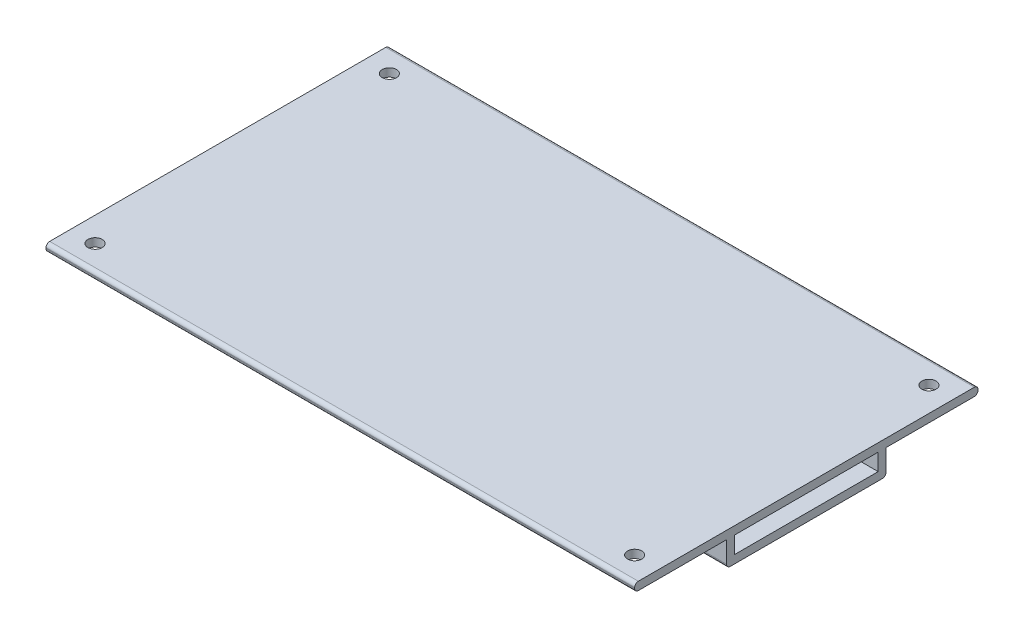
ISO-10303-21;
HEADER;
FILE_DESCRIPTION(('STEP AP214'),'2;1');
FILE_NAME('part.step','',(''),(''),'','','');
FILE_SCHEMA(('AUTOMOTIVE_DESIGN { 1 0 10303 214 1 1 1 1 }'));
ENDSEC;
DATA;
#1=APPLICATION_CONTEXT('core data for automotive mechanical design processes');
#2=APPLICATION_PROTOCOL_DEFINITION('international standard','automotive_design',2000,#1);
#3=PRODUCT_CONTEXT('',#1,'mechanical');
#4=PRODUCT('Part','Part','',(#3));
#5=PRODUCT_RELATED_PRODUCT_CATEGORY('part','',(#4));
#6=PRODUCT_DEFINITION_FORMATION('','',#4);
#7=PRODUCT_DEFINITION_CONTEXT('part definition',#1,'design');
#8=PRODUCT_DEFINITION('design','',#6,#7);
#9=PRODUCT_DEFINITION_SHAPE('','',#8);
#10=(LENGTH_UNIT() NAMED_UNIT(*) SI_UNIT(.MILLI.,.METRE.));
#11=(NAMED_UNIT(*) PLANE_ANGLE_UNIT() SI_UNIT($,.RADIAN.));
#12=(NAMED_UNIT(*) SI_UNIT($,.STERADIAN.) SOLID_ANGLE_UNIT());
#13=UNCERTAINTY_MEASURE_WITH_UNIT(LENGTH_MEASURE(1.E-05),#10,'distance_accuracy_value','');
#14=(GEOMETRIC_REPRESENTATION_CONTEXT(3) GLOBAL_UNCERTAINTY_ASSIGNED_CONTEXT((#13)) GLOBAL_UNIT_ASSIGNED_CONTEXT((#10,
#11,#12)) REPRESENTATION_CONTEXT('',''));
#15=CARTESIAN_POINT('',(0.,0.,0.));
#16=DIRECTION('',(0.,0.,1.));
#17=DIRECTION('',(1.,0.,0.));
#18=AXIS2_PLACEMENT_3D('',#15,#16,#17);
#19=CARTESIAN_POINT('',(120.,0.,0.));
#20=DIRECTION('',(-1.,0.,0.));
#21=DIRECTION('',(0.,0.,1.));
#22=AXIS2_PLACEMENT_3D('',#19,#20,#21);
#23=PLANE('',#22);
#24=DIRECTION('',(0.,0.,-1.));
#25=VECTOR('',#24,1.);
#26=CARTESIAN_POINT('',(120.,0.,-16.25));
#27=LINE('',#26,#25);
#28=CARTESIAN_POINT('',(120.,0.,15.5));
#29=VERTEX_POINT('',#28);
#30=CARTESIAN_POINT('',(120.,0.,-15.5));
#31=VERTEX_POINT('',#30);
#32=EDGE_CURVE('E204',#29,#31,#27,.T.);
#33=ORIENTED_EDGE('',*,*,#32,.T.);
#34=CARTESIAN_POINT('',(120.,0.750000000000005,-15.5));
#35=DIRECTION('',(-1.,0.,0.));
#36=DIRECTION('',(0.,0.,1.));
#37=AXIS2_PLACEMENT_3D('',#34,#35,#36);
#38=CIRCLE('',#37,0.75);
#39=CARTESIAN_POINT('',(120.,0.750000000000005,-16.25));
#40=VERTEX_POINT('',#39);
#41=EDGE_CURVE('E279',#31,#40,#38,.F.);
#42=ORIENTED_EDGE('',*,*,#41,.T.);
#43=DIRECTION('',(0.,1.,0.));
#44=VECTOR('',#43,1.);
#45=CARTESIAN_POINT('',(120.,5.1,-16.25));
#46=LINE('',#45,#44);
#47=CARTESIAN_POINT('',(120.,5.1,-16.25));
#48=VERTEX_POINT('',#47);
#49=EDGE_CURVE('E207',#40,#48,#46,.T.);
#50=ORIENTED_EDGE('',*,*,#49,.T.);
#51=DIRECTION('',(0.,0.,-1.));
#52=VECTOR('',#51,1.);
#53=CARTESIAN_POINT('',(120.,5.09999999999999,-35.));
#54=LINE('',#53,#52);
#55=CARTESIAN_POINT('',(120.,5.09999999999999,-34.25));
#56=VERTEX_POINT('',#55);
#57=EDGE_CURVE('E210',#48,#56,#54,.T.);
#58=ORIENTED_EDGE('',*,*,#57,.T.);
#59=CARTESIAN_POINT('',(120.,5.84999999999999,-34.25));
#60=DIRECTION('',(-1.,0.,0.));
#61=DIRECTION('',(0.,0.,1.));
#62=AXIS2_PLACEMENT_3D('',#59,#60,#61);
#63=CIRCLE('',#62,0.75);
#64=CARTESIAN_POINT('',(120.,5.84999999999999,-35.));
#65=VERTEX_POINT('',#64);
#66=EDGE_CURVE('E275',#56,#65,#63,.F.);
#67=ORIENTED_EDGE('',*,*,#66,.T.);
#68=DIRECTION('',(0.,1.,0.));
#69=VECTOR('',#68,1.);
#70=CARTESIAN_POINT('',(120.,6.75999999999999,-35.));
#71=LINE('',#70,#69);
#72=CARTESIAN_POINT('',(120.,6.00999999999999,-35.));
#73=VERTEX_POINT('',#72);
#74=EDGE_CURVE('E213',#65,#73,#71,.T.);
#75=ORIENTED_EDGE('',*,*,#74,.T.);
#76=CARTESIAN_POINT('',(120.,6.00999999999999,-34.25));
#77=DIRECTION('',(-1.,0.,0.));
#78=DIRECTION('',(0.,0.,1.));
#79=AXIS2_PLACEMENT_3D('',#76,#77,#78);
#80=CIRCLE('',#79,0.75);
#81=CARTESIAN_POINT('',(120.,6.75999999999999,-34.25));
#82=VERTEX_POINT('',#81);
#83=EDGE_CURVE('E273',#73,#82,#80,.F.);
#84=ORIENTED_EDGE('',*,*,#83,.T.);
#85=DIRECTION('',(0.,0.,1.));
#86=VECTOR('',#85,1.);
#87=CARTESIAN_POINT('',(120.,6.75999999999999,35.));
#88=LINE('',#87,#86);
#89=CARTESIAN_POINT('',(120.,6.75999999999999,34.25));
#90=VERTEX_POINT('',#89);
#91=EDGE_CURVE('E216',#82,#90,#88,.T.);
#92=ORIENTED_EDGE('',*,*,#91,.T.);
#93=CARTESIAN_POINT('',(120.,6.00999999999999,34.25));
#94=DIRECTION('',(-1.,0.,0.));
#95=DIRECTION('',(0.,0.,1.));
#96=AXIS2_PLACEMENT_3D('',#93,#94,#95);
#97=CIRCLE('',#96,0.75);
#98=CARTESIAN_POINT('',(120.,6.00999999999999,35.));
#99=VERTEX_POINT('',#98);
#100=EDGE_CURVE('E270',#90,#99,#97,.F.);
#101=ORIENTED_EDGE('',*,*,#100,.T.);
#102=DIRECTION('',(0.,-1.,0.));
#103=VECTOR('',#102,1.);
#104=CARTESIAN_POINT('',(120.,5.09999999999999,35.));
#105=LINE('',#104,#103);
#106=CARTESIAN_POINT('',(120.,5.84999999999999,35.));
#107=VERTEX_POINT('',#106);
#108=EDGE_CURVE('E219',#99,#107,#105,.T.);
#109=ORIENTED_EDGE('',*,*,#108,.T.);
#110=CARTESIAN_POINT('',(120.,5.84999999999999,34.25));
#111=DIRECTION('',(-1.,0.,0.));
#112=DIRECTION('',(0.,0.,1.));
#113=AXIS2_PLACEMENT_3D('',#110,#111,#112);
#114=CIRCLE('',#113,0.75);
#115=CARTESIAN_POINT('',(120.,5.09999999999999,34.25));
#116=VERTEX_POINT('',#115);
#117=EDGE_CURVE('E56',#107,#116,#114,.F.);
#118=ORIENTED_EDGE('',*,*,#117,.T.);
#119=DIRECTION('',(0.,0.,-1.));
#120=VECTOR('',#119,1.);
#121=CARTESIAN_POINT('',(120.,5.09999999999999,16.25));
#122=LINE('',#121,#120);
#123=CARTESIAN_POINT('',(120.,5.09999999999999,16.25));
#124=VERTEX_POINT('',#123);
#125=EDGE_CURVE('E221',#116,#124,#122,.T.);
#126=ORIENTED_EDGE('',*,*,#125,.T.);
#127=DIRECTION('',(0.,-1.,0.));
#128=VECTOR('',#127,1.);
#129=CARTESIAN_POINT('',(120.,0.,16.25));
#130=LINE('',#129,#128);
#131=CARTESIAN_POINT('',(120.,0.749999999999995,16.25));
#132=VERTEX_POINT('',#131);
#133=EDGE_CURVE('E223',#124,#132,#130,.T.);
#134=ORIENTED_EDGE('',*,*,#133,.T.);
#135=CARTESIAN_POINT('',(120.,0.749999999999995,15.5));
#136=DIRECTION('',(-1.,0.,0.));
#137=DIRECTION('',(0.,0.,1.));
#138=AXIS2_PLACEMENT_3D('',#135,#136,#137);
#139=CIRCLE('',#138,0.75);
#140=EDGE_CURVE('E277',#132,#29,#139,.F.);
#141=ORIENTED_EDGE('',*,*,#140,.T.);
#142=EDGE_LOOP('',(#33,#42,#50,#58,#67,#75,#84,#92,#101,#109,#118,#126,#134,#141));
#143=FACE_BOUND('',#142,.T.);
#144=DIRECTION('',(0.,1.,0.));
#145=VECTOR('',#144,1.);
#146=CARTESIAN_POINT('',(120.,5.1,-14.65));
#147=LINE('',#146,#145);
#148=CARTESIAN_POINT('',(120.,1.66,-14.65));
#149=VERTEX_POINT('',#148);
#150=CARTESIAN_POINT('',(120.,5.1,-14.65));
#151=VERTEX_POINT('',#150);
#152=EDGE_CURVE('E161',#149,#151,#147,.T.);
#153=ORIENTED_EDGE('',*,*,#152,.F.);
#154=DIRECTION('',(0.,0.,-1.));
#155=VECTOR('',#154,1.);
#156=CARTESIAN_POINT('',(120.,1.66,14.65));
#157=LINE('',#156,#155);
#158=CARTESIAN_POINT('',(120.,1.66,14.65));
#159=VERTEX_POINT('',#158);
#160=EDGE_CURVE('E186',#159,#149,#157,.T.);
#161=ORIENTED_EDGE('',*,*,#160,.F.);
#162=DIRECTION('',(0.,-1.,0.));
#163=VECTOR('',#162,1.);
#164=CARTESIAN_POINT('',(120.,5.1,14.65));
#165=LINE('',#164,#163);
#166=CARTESIAN_POINT('',(120.,5.1,14.65));
#167=VERTEX_POINT('',#166);
#168=EDGE_CURVE('E184',#167,#159,#165,.T.);
#169=ORIENTED_EDGE('',*,*,#168,.F.);
#170=DIRECTION('',(0.,0.,1.));
#171=VECTOR('',#170,1.);
#172=CARTESIAN_POINT('',(120.,5.1,14.65));
#173=LINE('',#172,#171);
#174=EDGE_CURVE('E171',#151,#167,#173,.T.);
#175=ORIENTED_EDGE('',*,*,#174,.F.);
#176=EDGE_LOOP('',(#153,#161,#169,#175));
#177=FACE_BOUND('',#176,.T.);
#178=ADVANCED_FACE('F33',(#143,#177),#23,.F.);
#179=CARTESIAN_POINT('',(0.,0.,0.));
#180=DIRECTION('',(-1.,0.,0.));
#181=DIRECTION('',(0.,0.,1.));
#182=AXIS2_PLACEMENT_3D('',#179,#180,#181);
#183=PLANE('',#182);
#184=DIRECTION('',(0.,1.,0.));
#185=VECTOR('',#184,1.);
#186=CARTESIAN_POINT('',(0.,5.1,-16.25));
#187=LINE('',#186,#185);
#188=CARTESIAN_POINT('',(0.,0.750000000000005,-16.25));
#189=VERTEX_POINT('',#188);
#190=CARTESIAN_POINT('',(0.,5.1,-16.25));
#191=VERTEX_POINT('',#190);
#192=EDGE_CURVE('E228',#189,#191,#187,.T.);
#193=ORIENTED_EDGE('',*,*,#192,.F.);
#194=CARTESIAN_POINT('',(0.,0.750000000000005,-15.5));
#195=DIRECTION('',(-1.,0.,0.));
#196=DIRECTION('',(0.,0.,1.));
#197=AXIS2_PLACEMENT_3D('',#194,#195,#196);
#198=CIRCLE('',#197,0.75);
#199=CARTESIAN_POINT('',(0.,0.,-15.5));
#200=VERTEX_POINT('',#199);
#201=EDGE_CURVE('E263',#189,#200,#198,.T.);
#202=ORIENTED_EDGE('',*,*,#201,.T.);
#203=DIRECTION('',(0.,0.,-1.));
#204=VECTOR('',#203,1.);
#205=CARTESIAN_POINT('',(0.,0.,-16.25));
#206=LINE('',#205,#204);
#207=CARTESIAN_POINT('',(0.,0.,15.5));
#208=VERTEX_POINT('',#207);
#209=EDGE_CURVE('E179',#208,#200,#206,.T.);
#210=ORIENTED_EDGE('',*,*,#209,.F.);
#211=CARTESIAN_POINT('',(0.,0.749999999999995,15.5));
#212=DIRECTION('',(-1.,0.,0.));
#213=DIRECTION('',(0.,0.,1.));
#214=AXIS2_PLACEMENT_3D('',#211,#212,#213);
#215=CIRCLE('',#214,0.75);
#216=CARTESIAN_POINT('',(0.,0.749999999999995,16.25));
#217=VERTEX_POINT('',#216);
#218=EDGE_CURVE('E261',#208,#217,#215,.T.);
#219=ORIENTED_EDGE('',*,*,#218,.T.);
#220=DIRECTION('',(0.,-1.,0.));
#221=VECTOR('',#220,1.);
#222=CARTESIAN_POINT('',(0.,0.,16.25));
#223=LINE('',#222,#221);
#224=CARTESIAN_POINT('',(0.,5.09999999999999,16.25));
#225=VERTEX_POINT('',#224);
#226=EDGE_CURVE('E208',#225,#217,#223,.T.);
#227=ORIENTED_EDGE('',*,*,#226,.F.);
#228=DIRECTION('',(0.,0.,-1.));
#229=VECTOR('',#228,1.);
#230=CARTESIAN_POINT('',(0.,5.09999999999999,16.25));
#231=LINE('',#230,#229);
#232=CARTESIAN_POINT('',(0.,5.09999999999999,34.25));
#233=VERTEX_POINT('',#232);
#234=EDGE_CURVE('E242',#233,#225,#231,.T.);
#235=ORIENTED_EDGE('',*,*,#234,.F.);
#236=CARTESIAN_POINT('',(0.,5.84999999999999,34.25));
#237=DIRECTION('',(-1.,0.,0.));
#238=DIRECTION('',(0.,0.,1.));
#239=AXIS2_PLACEMENT_3D('',#236,#237,#238);
#240=CIRCLE('',#239,0.75);
#241=CARTESIAN_POINT('',(0.,5.84999999999999,35.));
#242=VERTEX_POINT('',#241);
#243=EDGE_CURVE('E255',#233,#242,#240,.T.);
#244=ORIENTED_EDGE('',*,*,#243,.T.);
#245=DIRECTION('',(0.,-1.,0.));
#246=VECTOR('',#245,1.);
#247=CARTESIAN_POINT('',(0.,5.09999999999999,35.));
#248=LINE('',#247,#246);
#249=CARTESIAN_POINT('',(0.,6.00999999999999,35.));
#250=VERTEX_POINT('',#249);
#251=EDGE_CURVE('E239',#250,#242,#248,.T.);
#252=ORIENTED_EDGE('',*,*,#251,.F.);
#253=CARTESIAN_POINT('',(0.,6.00999999999999,34.25));
#254=DIRECTION('',(-1.,0.,0.));
#255=DIRECTION('',(0.,0.,1.));
#256=AXIS2_PLACEMENT_3D('',#253,#254,#255);
#257=CIRCLE('',#256,0.75);
#258=CARTESIAN_POINT('',(0.,6.75999999999999,34.25));
#259=VERTEX_POINT('',#258);
#260=EDGE_CURVE('E253',#250,#259,#257,.T.);
#261=ORIENTED_EDGE('',*,*,#260,.T.);
#262=DIRECTION('',(0.,0.,1.));
#263=VECTOR('',#262,1.);
#264=CARTESIAN_POINT('',(0.,6.75999999999999,35.));
#265=LINE('',#264,#263);
#266=CARTESIAN_POINT('',(0.,6.75999999999999,-34.25));
#267=VERTEX_POINT('',#266);
#268=EDGE_CURVE('E236',#267,#259,#265,.T.);
#269=ORIENTED_EDGE('',*,*,#268,.F.);
#270=CARTESIAN_POINT('',(0.,6.00999999999999,-34.25));
#271=DIRECTION('',(-1.,0.,0.));
#272=DIRECTION('',(0.,0.,1.));
#273=AXIS2_PLACEMENT_3D('',#270,#271,#272);
#274=CIRCLE('',#273,0.75);
#275=CARTESIAN_POINT('',(0.,6.00999999999999,-35.));
#276=VERTEX_POINT('',#275);
#277=EDGE_CURVE('E257',#267,#276,#274,.T.);
#278=ORIENTED_EDGE('',*,*,#277,.T.);
#279=DIRECTION('',(0.,1.,0.));
#280=VECTOR('',#279,1.);
#281=CARTESIAN_POINT('',(0.,6.75999999999999,-35.));
#282=LINE('',#281,#280);
#283=CARTESIAN_POINT('',(0.,5.84999999999999,-35.));
#284=VERTEX_POINT('',#283);
#285=EDGE_CURVE('E233',#284,#276,#282,.T.);
#286=ORIENTED_EDGE('',*,*,#285,.F.);
#287=CARTESIAN_POINT('',(0.,5.84999999999999,-34.25));
#288=DIRECTION('',(-1.,0.,0.));
#289=DIRECTION('',(0.,0.,1.));
#290=AXIS2_PLACEMENT_3D('',#287,#288,#289);
#291=CIRCLE('',#290,0.75);
#292=CARTESIAN_POINT('',(0.,5.09999999999999,-34.25));
#293=VERTEX_POINT('',#292);
#294=EDGE_CURVE('E259',#284,#293,#291,.T.);
#295=ORIENTED_EDGE('',*,*,#294,.T.);
#296=DIRECTION('',(0.,0.,-1.));
#297=VECTOR('',#296,1.);
#298=CARTESIAN_POINT('',(0.,5.09999999999999,-35.));
#299=LINE('',#298,#297);
#300=EDGE_CURVE('E230',#191,#293,#299,.T.);
#301=ORIENTED_EDGE('',*,*,#300,.F.);
#302=EDGE_LOOP('',(#193,#202,#210,#219,#227,#235,#244,#252,#261,#269,#278,#286,#295,#301));
#303=FACE_BOUND('',#302,.T.);
#304=DIRECTION('',(0.,0.,-1.));
#305=VECTOR('',#304,1.);
#306=CARTESIAN_POINT('',(0.,1.66,14.65));
#307=LINE('',#306,#305);
#308=CARTESIAN_POINT('',(0.,1.66,14.65));
#309=VERTEX_POINT('',#308);
#310=CARTESIAN_POINT('',(0.,1.66,-14.65));
#311=VERTEX_POINT('',#310);
#312=EDGE_CURVE('E172',#309,#311,#307,.T.);
#313=ORIENTED_EDGE('',*,*,#312,.T.);
#314=DIRECTION('',(0.,1.,0.));
#315=VECTOR('',#314,1.);
#316=CARTESIAN_POINT('',(0.,5.1,-14.65));
#317=LINE('',#316,#315);
#318=CARTESIAN_POINT('',(0.,5.1,-14.65));
#319=VERTEX_POINT('',#318);
#320=EDGE_CURVE('E191',#311,#319,#317,.T.);
#321=ORIENTED_EDGE('',*,*,#320,.T.);
#322=DIRECTION('',(0.,0.,1.));
#323=VECTOR('',#322,1.);
#324=CARTESIAN_POINT('',(0.,5.1,14.65));
#325=LINE('',#324,#323);
#326=CARTESIAN_POINT('',(0.,5.1,14.65));
#327=VERTEX_POINT('',#326);
#328=EDGE_CURVE('E178',#319,#327,#325,.T.);
#329=ORIENTED_EDGE('',*,*,#328,.T.);
#330=DIRECTION('',(0.,-1.,0.));
#331=VECTOR('',#330,1.);
#332=CARTESIAN_POINT('',(0.,5.1,14.65));
#333=LINE('',#332,#331);
#334=EDGE_CURVE('E195',#327,#309,#333,.T.);
#335=ORIENTED_EDGE('',*,*,#334,.T.);
#336=EDGE_LOOP('',(#313,#321,#329,#335));
#337=FACE_BOUND('',#336,.T.);
#338=ADVANCED_FACE('F307',(#303,#337),#183,.T.);
#339=CARTESIAN_POINT('',(120.,0.,-16.25));
#340=DIRECTION('',(0.,1.,0.));
#341=DIRECTION('',(0.,0.,1.));
#342=AXIS2_PLACEMENT_3D('',#339,#340,#341);
#343=PLANE('',#342);
#344=ORIENTED_EDGE('',*,*,#209,.T.);
#345=DIRECTION('',(-1.,0.,0.));
#346=VECTOR('',#345,1.);
#347=CARTESIAN_POINT('',(120.,0.,-15.5));
#348=LINE('',#347,#346);
#349=EDGE_CURVE('E268',#200,#31,#348,.F.);
#350=ORIENTED_EDGE('',*,*,#349,.T.);
#351=ORIENTED_EDGE('',*,*,#32,.F.);
#352=DIRECTION('',(-1.,0.,0.));
#353=VECTOR('',#352,1.);
#354=CARTESIAN_POINT('',(120.,0.,15.5));
#355=LINE('',#354,#353);
#356=EDGE_CURVE('E265',#29,#208,#355,.T.);
#357=ORIENTED_EDGE('',*,*,#356,.T.);
#358=EDGE_LOOP('',(#344,#350,#351,#357));
#359=FACE_BOUND('',#358,.T.);
#360=ADVANCED_FACE('F325',(#359),#343,.F.);
#361=CARTESIAN_POINT('',(120.,5.1,-16.25));
#362=DIRECTION('',(0.,0.,1.));
#363=DIRECTION('',(1.,0.,0.));
#364=AXIS2_PLACEMENT_3D('',#361,#362,#363);
#365=PLANE('',#364);
#366=ORIENTED_EDGE('',*,*,#49,.F.);
#367=DIRECTION('',(-1.,0.,0.));
#368=VECTOR('',#367,1.);
#369=CARTESIAN_POINT('',(120.,0.750000000000005,-16.25));
#370=LINE('',#369,#368);
#371=EDGE_CURVE('E250',#40,#189,#370,.T.);
#372=ORIENTED_EDGE('',*,*,#371,.T.);
#373=ORIENTED_EDGE('',*,*,#192,.T.);
#374=DIRECTION('',(-1.,0.,0.));
#375=VECTOR('',#374,1.);
#376=CARTESIAN_POINT('',(120.,5.1,-16.25));
#377=LINE('',#376,#375);
#378=EDGE_CURVE('E247',#48,#191,#377,.T.);
#379=ORIENTED_EDGE('',*,*,#378,.F.);
#380=EDGE_LOOP('',(#366,#372,#373,#379));
#381=FACE_BOUND('',#380,.T.);
#382=ADVANCED_FACE('F334',(#381),#365,.F.);
#383=CARTESIAN_POINT('',(120.,5.09999999999999,-35.));
#384=DIRECTION('',(0.,1.,0.));
#385=DIRECTION('',(0.,0.,1.));
#386=AXIS2_PLACEMENT_3D('',#383,#384,#385);
#387=PLANE('',#386);
#388=CARTESIAN_POINT('',(5.,5.09999999999999,-30.));
#389=DIRECTION('',(0.,1.,0.));
#390=DIRECTION('',(0.,0.,1.));
#391=AXIS2_PLACEMENT_3D('',#388,#389,#390);
#392=CIRCLE('',#391,1.45);
#393=CARTESIAN_POINT('',(5.,5.09999999999999,-28.55));
#394=VERTEX_POINT('',#393);
#395=EDGE_CURVE('E571',#394,#394,#392,.F.);
#396=ORIENTED_EDGE('',*,*,#395,.F.);
#397=EDGE_LOOP('',(#396));
#398=FACE_BOUND('',#397,.T.);
#399=CARTESIAN_POINT('',(115.,5.09999999999999,-30.));
#400=DIRECTION('',(0.,1.,0.));
#401=DIRECTION('',(0.,0.,1.));
#402=AXIS2_PLACEMENT_3D('',#399,#400,#401);
#403=CIRCLE('',#402,1.45);
#404=CARTESIAN_POINT('',(115.,5.09999999999999,-28.55));
#405=VERTEX_POINT('',#404);
#406=EDGE_CURVE('E193',#405,#405,#403,.F.);
#407=ORIENTED_EDGE('',*,*,#406,.F.);
#408=EDGE_LOOP('',(#407));
#409=FACE_BOUND('',#408,.T.);
#410=ORIENTED_EDGE('',*,*,#300,.T.);
#411=DIRECTION('',(-1.,0.,0.));
#412=VECTOR('',#411,1.);
#413=CARTESIAN_POINT('',(120.,5.09999999999999,-34.25));
#414=LINE('',#413,#412);
#415=EDGE_CURVE('E287',#293,#56,#414,.F.);
#416=ORIENTED_EDGE('',*,*,#415,.T.);
#417=ORIENTED_EDGE('',*,*,#57,.F.);
#418=ORIENTED_EDGE('',*,*,#378,.T.);
#419=EDGE_LOOP('',(#410,#416,#417,#418));
#420=FACE_BOUND('',#419,.T.);
#421=ADVANCED_FACE('F387',(#398,#409,#420),#387,.F.);
#422=CARTESIAN_POINT('',(120.,6.75999999999999,-35.));
#423=DIRECTION('',(0.,0.,1.));
#424=DIRECTION('',(1.,0.,0.));
#425=AXIS2_PLACEMENT_3D('',#422,#423,#424);
#426=PLANE('',#425);
#427=ORIENTED_EDGE('',*,*,#74,.F.);
#428=DIRECTION('',(-1.,0.,0.));
#429=VECTOR('',#428,1.);
#430=CARTESIAN_POINT('',(120.,5.84999999999999,-35.));
#431=LINE('',#430,#429);
#432=EDGE_CURVE('E284',#65,#284,#431,.T.);
#433=ORIENTED_EDGE('',*,*,#432,.T.);
#434=ORIENTED_EDGE('',*,*,#285,.T.);
#435=DIRECTION('',(-1.,0.,0.));
#436=VECTOR('',#435,1.);
#437=CARTESIAN_POINT('',(120.,6.00999999999999,-35.));
#438=LINE('',#437,#436);
#439=EDGE_CURVE('E282',#276,#73,#438,.F.);
#440=ORIENTED_EDGE('',*,*,#439,.T.);
#441=EDGE_LOOP('',(#427,#433,#434,#440));
#442=FACE_BOUND('',#441,.T.);
#443=ADVANCED_FACE('F346',(#442),#426,.F.);
#444=CARTESIAN_POINT('',(120.,6.75999999999999,35.));
#445=DIRECTION('',(0.,-1.,0.));
#446=DIRECTION('',(0.,0.,-1.));
#447=AXIS2_PLACEMENT_3D('',#444,#445,#446);
#448=PLANE('',#447);
#449=CARTESIAN_POINT('',(115.,6.75999999999999,30.));
#450=DIRECTION('',(0.,1.,0.));
#451=DIRECTION('',(0.,0.,-1.));
#452=AXIS2_PLACEMENT_3D('',#449,#450,#451);
#453=CIRCLE('',#452,1.45);
#454=CARTESIAN_POINT('',(115.,6.75999999999999,28.55));
#455=VERTEX_POINT('',#454);
#456=EDGE_CURVE('E585',#455,#455,#453,.T.);
#457=ORIENTED_EDGE('',*,*,#456,.F.);
#458=EDGE_LOOP('',(#457));
#459=FACE_BOUND('',#458,.T.);
#460=CARTESIAN_POINT('',(5.,6.75999999999999,30.));
#461=DIRECTION('',(0.,1.,0.));
#462=DIRECTION('',(0.,0.,-1.));
#463=AXIS2_PLACEMENT_3D('',#460,#461,#462);
#464=CIRCLE('',#463,1.45);
#465=CARTESIAN_POINT('',(5.,6.75999999999999,28.55));
#466=VERTEX_POINT('',#465);
#467=EDGE_CURVE('E579',#466,#466,#464,.T.);
#468=ORIENTED_EDGE('',*,*,#467,.F.);
#469=EDGE_LOOP('',(#468));
#470=FACE_BOUND('',#469,.T.);
#471=CARTESIAN_POINT('',(5.,6.75999999999999,-30.));
#472=DIRECTION('',(0.,1.,0.));
#473=DIRECTION('',(0.,0.,1.));
#474=AXIS2_PLACEMENT_3D('',#471,#472,#473);
#475=CIRCLE('',#474,1.45);
#476=CARTESIAN_POINT('',(5.,6.75999999999999,-28.55));
#477=VERTEX_POINT('',#476);
#478=EDGE_CURVE('E568',#477,#477,#475,.T.);
#479=ORIENTED_EDGE('',*,*,#478,.F.);
#480=EDGE_LOOP('',(#479));
#481=FACE_BOUND('',#480,.T.);
#482=CARTESIAN_POINT('',(115.,6.75999999999999,-30.));
#483=DIRECTION('',(0.,1.,0.));
#484=DIRECTION('',(0.,0.,1.));
#485=AXIS2_PLACEMENT_3D('',#482,#483,#484);
#486=CIRCLE('',#485,1.45);
#487=CARTESIAN_POINT('',(115.,6.75999999999999,-28.55));
#488=VERTEX_POINT('',#487);
#489=EDGE_CURVE('E572',#488,#488,#486,.T.);
#490=ORIENTED_EDGE('',*,*,#489,.F.);
#491=EDGE_LOOP('',(#490));
#492=FACE_BOUND('',#491,.T.);
#493=ORIENTED_EDGE('',*,*,#91,.F.);
#494=DIRECTION('',(-1.,0.,0.));
#495=VECTOR('',#494,1.);
#496=CARTESIAN_POINT('',(120.,6.75999999999999,-34.25));
#497=LINE('',#496,#495);
#498=EDGE_CURVE('E291',#82,#267,#497,.T.);
#499=ORIENTED_EDGE('',*,*,#498,.T.);
#500=ORIENTED_EDGE('',*,*,#268,.T.);
#501=DIRECTION('',(-1.,0.,0.));
#502=VECTOR('',#501,1.);
#503=CARTESIAN_POINT('',(120.,6.75999999999999,34.25));
#504=LINE('',#503,#502);
#505=EDGE_CURVE('E289',#259,#90,#504,.F.);
#506=ORIENTED_EDGE('',*,*,#505,.T.);
#507=EDGE_LOOP('',(#493,#499,#500,#506));
#508=FACE_BOUND('',#507,.T.);
#509=ADVANCED_FACE('F354',(#459,#470,#481,#492,#508),#448,.F.);
#510=CARTESIAN_POINT('',(120.,5.09999999999999,35.));
#511=DIRECTION('',(0.,0.,-1.));
#512=DIRECTION('',(0.,1.,0.));
#513=AXIS2_PLACEMENT_3D('',#510,#511,#512);
#514=PLANE('',#513);
#515=ORIENTED_EDGE('',*,*,#251,.T.);
#516=DIRECTION('',(-1.,0.,0.));
#517=VECTOR('',#516,1.);
#518=CARTESIAN_POINT('',(120.,5.84999999999999,35.));
#519=LINE('',#518,#517);
#520=EDGE_CURVE('E11',#242,#107,#519,.F.);
#521=ORIENTED_EDGE('',*,*,#520,.T.);
#522=ORIENTED_EDGE('',*,*,#108,.F.);
#523=DIRECTION('',(-1.,0.,0.));
#524=VECTOR('',#523,1.);
#525=CARTESIAN_POINT('',(120.,6.00999999999999,35.));
#526=LINE('',#525,#524);
#527=EDGE_CURVE('E41',#99,#250,#526,.T.);
#528=ORIENTED_EDGE('',*,*,#527,.T.);
#529=EDGE_LOOP('',(#515,#521,#522,#528));
#530=FACE_BOUND('',#529,.T.);
#531=ADVANCED_FACE('F301',(#530),#514,.F.);
#532=CARTESIAN_POINT('',(120.,5.09999999999999,16.25));
#533=DIRECTION('',(0.,1.,0.));
#534=DIRECTION('',(0.,0.,1.));
#535=AXIS2_PLACEMENT_3D('',#532,#533,#534);
#536=PLANE('',#535);
#537=CARTESIAN_POINT('',(115.,5.09999999999999,30.));
#538=DIRECTION('',(0.,1.,0.));
#539=DIRECTION('',(0.,0.,1.));
#540=AXIS2_PLACEMENT_3D('',#537,#538,#539);
#541=CIRCLE('',#540,1.45);
#542=CARTESIAN_POINT('',(115.,5.09999999999999,31.45));
#543=VERTEX_POINT('',#542);
#544=EDGE_CURVE('E582',#543,#543,#541,.F.);
#545=ORIENTED_EDGE('',*,*,#544,.F.);
#546=EDGE_LOOP('',(#545));
#547=FACE_BOUND('',#546,.T.);
#548=CARTESIAN_POINT('',(5.,5.09999999999999,30.));
#549=DIRECTION('',(0.,1.,0.));
#550=DIRECTION('',(0.,0.,1.));
#551=AXIS2_PLACEMENT_3D('',#548,#549,#550);
#552=CIRCLE('',#551,1.45);
#553=CARTESIAN_POINT('',(5.,5.09999999999999,31.45));
#554=VERTEX_POINT('',#553);
#555=EDGE_CURVE('E576',#554,#554,#552,.F.);
#556=ORIENTED_EDGE('',*,*,#555,.F.);
#557=EDGE_LOOP('',(#556));
#558=FACE_BOUND('',#557,.T.);
#559=ORIENTED_EDGE('',*,*,#125,.F.);
#560=DIRECTION('',(-1.,0.,0.));
#561=VECTOR('',#560,1.);
#562=CARTESIAN_POINT('',(120.,5.09999999999999,34.25));
#563=LINE('',#562,#561);
#564=EDGE_CURVE('E294',#116,#233,#563,.T.);
#565=ORIENTED_EDGE('',*,*,#564,.T.);
#566=ORIENTED_EDGE('',*,*,#234,.T.);
#567=DIRECTION('',(-1.,0.,0.));
#568=VECTOR('',#567,1.);
#569=CARTESIAN_POINT('',(120.,5.09999999999999,16.25));
#570=LINE('',#569,#568);
#571=EDGE_CURVE('E225',#124,#225,#570,.T.);
#572=ORIENTED_EDGE('',*,*,#571,.F.);
#573=EDGE_LOOP('',(#559,#565,#566,#572));
#574=FACE_BOUND('',#573,.T.);
#575=ADVANCED_FACE('F316',(#547,#558,#574),#536,.F.);
#576=CARTESIAN_POINT('',(120.,0.,16.25));
#577=DIRECTION('',(0.,0.,-1.));
#578=DIRECTION('',(-1.,0.,0.));
#579=AXIS2_PLACEMENT_3D('',#576,#577,#578);
#580=PLANE('',#579);
#581=ORIENTED_EDGE('',*,*,#226,.T.);
#582=DIRECTION('',(-1.,0.,0.));
#583=VECTOR('',#582,1.);
#584=CARTESIAN_POINT('',(120.,0.749999999999995,16.25));
#585=LINE('',#584,#583);
#586=EDGE_CURVE('E48',#217,#132,#585,.F.);
#587=ORIENTED_EDGE('',*,*,#586,.T.);
#588=ORIENTED_EDGE('',*,*,#133,.F.);
#589=ORIENTED_EDGE('',*,*,#571,.T.);
#590=EDGE_LOOP('',(#581,#587,#588,#589));
#591=FACE_BOUND('',#590,.T.);
#592=ADVANCED_FACE('F374',(#591),#580,.F.);
#593=CARTESIAN_POINT('',(120.,5.1,-14.65));
#594=DIRECTION('',(0.,0.,1.));
#595=DIRECTION('',(1.,0.,0.));
#596=AXIS2_PLACEMENT_3D('',#593,#594,#595);
#597=PLANE('',#596);
#598=ORIENTED_EDGE('',*,*,#320,.F.);
#599=DIRECTION('',(-1.,0.,0.));
#600=VECTOR('',#599,1.);
#601=CARTESIAN_POINT('',(120.,1.66,-14.65));
#602=LINE('',#601,#600);
#603=EDGE_CURVE('E167',#149,#311,#602,.T.);
#604=ORIENTED_EDGE('',*,*,#603,.F.);
#605=ORIENTED_EDGE('',*,*,#152,.T.);
#606=DIRECTION('',(-1.,0.,0.));
#607=VECTOR('',#606,1.);
#608=CARTESIAN_POINT('',(120.,5.1,-14.65));
#609=LINE('',#608,#607);
#610=EDGE_CURVE('E164',#151,#319,#609,.T.);
#611=ORIENTED_EDGE('',*,*,#610,.T.);
#612=EDGE_LOOP('',(#598,#604,#605,#611));
#613=FACE_BOUND('',#612,.T.);
#614=ADVANCED_FACE('F163',(#613),#597,.T.);
#615=CARTESIAN_POINT('',(120.,5.1,14.65));
#616=DIRECTION('',(0.,-1.,0.));
#617=DIRECTION('',(0.,0.,-1.));
#618=AXIS2_PLACEMENT_3D('',#615,#616,#617);
#619=PLANE('',#618);
#620=ORIENTED_EDGE('',*,*,#328,.F.);
#621=ORIENTED_EDGE('',*,*,#610,.F.);
#622=ORIENTED_EDGE('',*,*,#174,.T.);
#623=DIRECTION('',(-1.,0.,0.));
#624=VECTOR('',#623,1.);
#625=CARTESIAN_POINT('',(120.,5.1,14.65));
#626=LINE('',#625,#624);
#627=EDGE_CURVE('E180',#167,#327,#626,.T.);
#628=ORIENTED_EDGE('',*,*,#627,.T.);
#629=EDGE_LOOP('',(#620,#621,#622,#628));
#630=FACE_BOUND('',#629,.T.);
#631=ADVANCED_FACE('F175',(#630),#619,.T.);
#632=CARTESIAN_POINT('',(120.,5.1,14.65));
#633=DIRECTION('',(0.,0.,-1.));
#634=DIRECTION('',(-1.,0.,0.));
#635=AXIS2_PLACEMENT_3D('',#632,#633,#634);
#636=PLANE('',#635);
#637=ORIENTED_EDGE('',*,*,#334,.F.);
#638=ORIENTED_EDGE('',*,*,#627,.F.);
#639=ORIENTED_EDGE('',*,*,#168,.T.);
#640=DIRECTION('',(-1.,0.,0.));
#641=VECTOR('',#640,1.);
#642=CARTESIAN_POINT('',(120.,1.66,14.65));
#643=LINE('',#642,#641);
#644=EDGE_CURVE('E201',#159,#309,#643,.T.);
#645=ORIENTED_EDGE('',*,*,#644,.T.);
#646=EDGE_LOOP('',(#637,#638,#639,#645));
#647=FACE_BOUND('',#646,.T.);
#648=ADVANCED_FACE('F481',(#647),#636,.T.);
#649=CARTESIAN_POINT('',(120.,1.66,14.65));
#650=DIRECTION('',(0.,1.,0.));
#651=DIRECTION('',(0.,0.,1.));
#652=AXIS2_PLACEMENT_3D('',#649,#650,#651);
#653=PLANE('',#652);
#654=ORIENTED_EDGE('',*,*,#312,.F.);
#655=ORIENTED_EDGE('',*,*,#644,.F.);
#656=ORIENTED_EDGE('',*,*,#160,.T.);
#657=ORIENTED_EDGE('',*,*,#603,.T.);
#658=EDGE_LOOP('',(#654,#655,#656,#657));
#659=FACE_BOUND('',#658,.T.);
#660=ADVANCED_FACE('F397',(#659),#653,.T.);
#661=CARTESIAN_POINT('',(120.,0.750000000000005,-15.5));
#662=DIRECTION('',(-1.,0.,0.));
#663=DIRECTION('',(0.,0.,1.));
#664=AXIS2_PLACEMENT_3D('',#661,#662,#663);
#665=CYLINDRICAL_SURFACE('',#664,0.75);
#666=ORIENTED_EDGE('',*,*,#41,.F.);
#667=ORIENTED_EDGE('',*,*,#349,.F.);
#668=ORIENTED_EDGE('',*,*,#201,.F.);
#669=ORIENTED_EDGE('',*,*,#371,.F.);
#670=EDGE_LOOP('',(#666,#667,#668,#669));
#671=FACE_BOUND('',#670,.T.);
#672=ADVANCED_FACE('F331',(#671),#665,.T.);
#673=CARTESIAN_POINT('',(120.,0.749999999999995,15.5));
#674=DIRECTION('',(-1.,0.,0.));
#675=DIRECTION('',(0.,0.,1.));
#676=AXIS2_PLACEMENT_3D('',#673,#674,#675);
#677=CYLINDRICAL_SURFACE('',#676,0.75);
#678=ORIENTED_EDGE('',*,*,#140,.F.);
#679=ORIENTED_EDGE('',*,*,#586,.F.);
#680=ORIENTED_EDGE('',*,*,#218,.F.);
#681=ORIENTED_EDGE('',*,*,#356,.F.);
#682=EDGE_LOOP('',(#678,#679,#680,#681));
#683=FACE_BOUND('',#682,.T.);
#684=ADVANCED_FACE('F322',(#683),#677,.T.);
#685=CARTESIAN_POINT('',(120.,5.84999999999999,-34.25));
#686=DIRECTION('',(-1.,0.,0.));
#687=DIRECTION('',(0.,0.,1.));
#688=AXIS2_PLACEMENT_3D('',#685,#686,#687);
#689=CYLINDRICAL_SURFACE('',#688,0.75);
#690=ORIENTED_EDGE('',*,*,#66,.F.);
#691=ORIENTED_EDGE('',*,*,#415,.F.);
#692=ORIENTED_EDGE('',*,*,#294,.F.);
#693=ORIENTED_EDGE('',*,*,#432,.F.);
#694=EDGE_LOOP('',(#690,#691,#692,#693));
#695=FACE_BOUND('',#694,.T.);
#696=ADVANCED_FACE('F343',(#695),#689,.T.);
#697=CARTESIAN_POINT('',(120.,6.00999999999999,-34.25));
#698=DIRECTION('',(-1.,0.,0.));
#699=DIRECTION('',(0.,0.,1.));
#700=AXIS2_PLACEMENT_3D('',#697,#698,#699);
#701=CYLINDRICAL_SURFACE('',#700,0.75);
#702=ORIENTED_EDGE('',*,*,#83,.F.);
#703=ORIENTED_EDGE('',*,*,#439,.F.);
#704=ORIENTED_EDGE('',*,*,#277,.F.);
#705=ORIENTED_EDGE('',*,*,#498,.F.);
#706=EDGE_LOOP('',(#702,#703,#704,#705));
#707=FACE_BOUND('',#706,.T.);
#708=ADVANCED_FACE('F351',(#707),#701,.T.);
#709=CARTESIAN_POINT('',(120.,5.84999999999999,34.25));
#710=DIRECTION('',(-1.,0.,0.));
#711=DIRECTION('',(0.,0.,1.));
#712=AXIS2_PLACEMENT_3D('',#709,#710,#711);
#713=CYLINDRICAL_SURFACE('',#712,0.75);
#714=ORIENTED_EDGE('',*,*,#117,.F.);
#715=ORIENTED_EDGE('',*,*,#520,.F.);
#716=ORIENTED_EDGE('',*,*,#243,.F.);
#717=ORIENTED_EDGE('',*,*,#564,.F.);
#718=EDGE_LOOP('',(#714,#715,#716,#717));
#719=FACE_BOUND('',#718,.T.);
#720=ADVANCED_FACE('F314',(#719),#713,.T.);
#721=CARTESIAN_POINT('',(120.,6.00999999999999,34.25));
#722=DIRECTION('',(-1.,0.,0.));
#723=DIRECTION('',(0.,0.,1.));
#724=AXIS2_PLACEMENT_3D('',#721,#722,#723);
#725=CYLINDRICAL_SURFACE('',#724,0.75);
#726=ORIENTED_EDGE('',*,*,#100,.F.);
#727=ORIENTED_EDGE('',*,*,#505,.F.);
#728=ORIENTED_EDGE('',*,*,#260,.F.);
#729=ORIENTED_EDGE('',*,*,#527,.F.);
#730=EDGE_LOOP('',(#726,#727,#728,#729));
#731=FACE_BOUND('',#730,.T.);
#732=ADVANCED_FACE('F35',(#731),#725,.T.);
#733=CARTESIAN_POINT('',(5.,-0.00100000000000447,30.));
#734=DIRECTION('',(0.,1.,0.));
#735=DIRECTION('',(0.,0.,1.));
#736=AXIS2_PLACEMENT_3D('',#733,#734,#735);
#737=CYLINDRICAL_SURFACE('',#736,1.45);
#738=ORIENTED_EDGE('',*,*,#467,.T.);
#739=EDGE_LOOP('',(#738));
#740=FACE_BOUND('',#739,.T.);
#741=ORIENTED_EDGE('',*,*,#555,.T.);
#742=EDGE_LOOP('',(#741));
#743=FACE_BOUND('',#742,.T.);
#744=ADVANCED_FACE('F357',(#740,#743),#737,.F.);
#745=CARTESIAN_POINT('',(115.,-0.00100000000000447,30.));
#746=DIRECTION('',(0.,1.,0.));
#747=DIRECTION('',(0.,0.,1.));
#748=AXIS2_PLACEMENT_3D('',#745,#746,#747);
#749=CYLINDRICAL_SURFACE('',#748,1.45);
#750=ORIENTED_EDGE('',*,*,#456,.T.);
#751=EDGE_LOOP('',(#750));
#752=FACE_BOUND('',#751,.T.);
#753=ORIENTED_EDGE('',*,*,#544,.T.);
#754=EDGE_LOOP('',(#753));
#755=FACE_BOUND('',#754,.T.);
#756=ADVANCED_FACE('F362',(#752,#755),#749,.F.);
#757=CARTESIAN_POINT('',(115.,-0.00100000000000447,-30.));
#758=DIRECTION('',(0.,1.,0.));
#759=DIRECTION('',(0.,0.,1.));
#760=AXIS2_PLACEMENT_3D('',#757,#758,#759);
#761=CYLINDRICAL_SURFACE('',#760,1.45);
#762=ORIENTED_EDGE('',*,*,#489,.T.);
#763=EDGE_LOOP('',(#762));
#764=FACE_BOUND('',#763,.T.);
#765=ORIENTED_EDGE('',*,*,#406,.T.);
#766=EDGE_LOOP('',(#765));
#767=FACE_BOUND('',#766,.T.);
#768=ADVANCED_FACE('F452',(#764,#767),#761,.F.);
#769=CARTESIAN_POINT('',(5.,-0.00100000000000447,-30.));
#770=DIRECTION('',(0.,1.,0.));
#771=DIRECTION('',(0.,0.,1.));
#772=AXIS2_PLACEMENT_3D('',#769,#770,#771);
#773=CYLINDRICAL_SURFACE('',#772,1.45);
#774=ORIENTED_EDGE('',*,*,#478,.T.);
#775=EDGE_LOOP('',(#774));
#776=FACE_BOUND('',#775,.T.);
#777=ORIENTED_EDGE('',*,*,#395,.T.);
#778=EDGE_LOOP('',(#777));
#779=FACE_BOUND('',#778,.T.);
#780=ADVANCED_FACE('F462',(#776,#779),#773,.F.);
#781=CLOSED_SHELL('',(#178,#338,#360,#382,#421,#443,#509,#531,#575,#592,#614,#631,#648,#660,
#672,#684,#696,#708,#720,#732,#744,#756,#768,#780));
#782=MANIFOLD_SOLID_BREP('B2',#781);
#783=ADVANCED_BREP_SHAPE_REPRESENTATION('',(#18,#782),#14);
#784=SHAPE_DEFINITION_REPRESENTATION(#9,#783);
ENDSEC;
END-ISO-10303-21;
